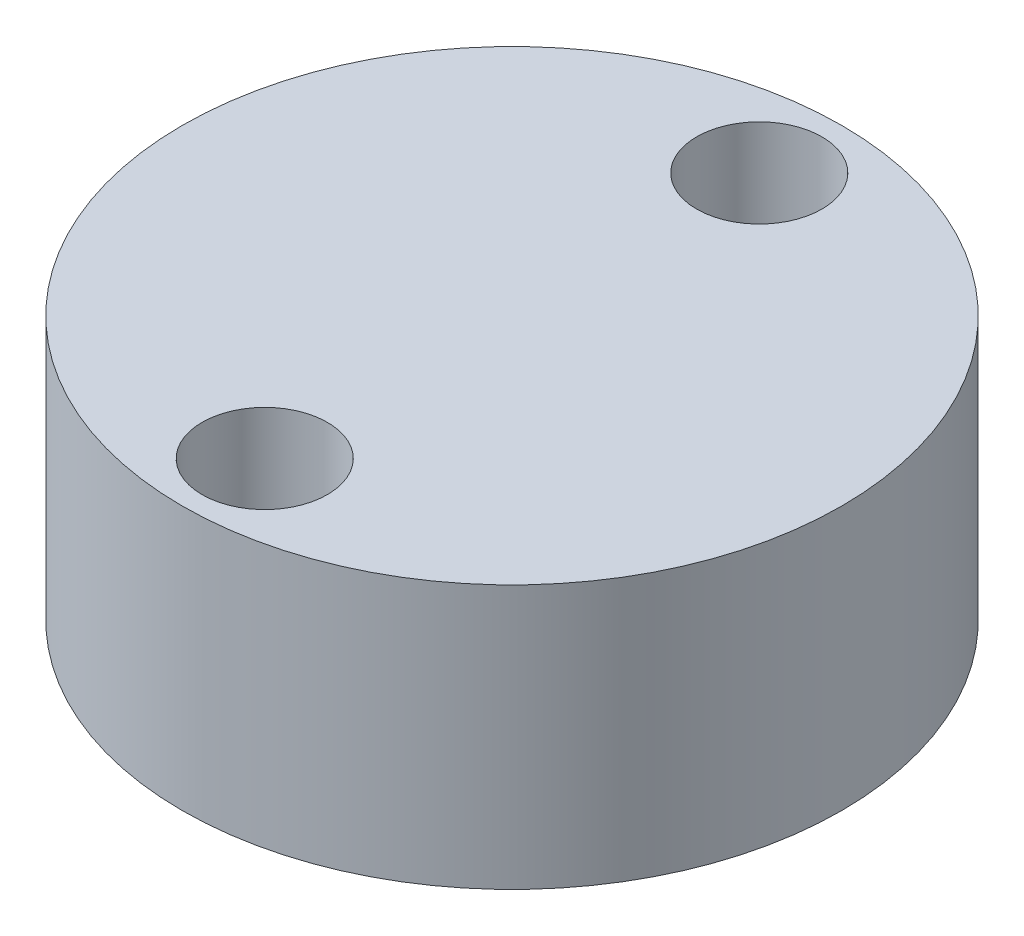
ISO-10303-21;
HEADER;
FILE_DESCRIPTION(('STEP AP214'),'2;1');
FILE_NAME('part.step','',(''),(''),'','','');
FILE_SCHEMA(('AUTOMOTIVE_DESIGN { 1 0 10303 214 1 1 1 1 }'));
ENDSEC;
DATA;
#1=APPLICATION_CONTEXT('core data for automotive mechanical design processes');
#2=APPLICATION_PROTOCOL_DEFINITION('international standard','automotive_design',2000,#1);
#3=PRODUCT_CONTEXT('',#1,'mechanical');
#4=PRODUCT('Part','Part','',(#3));
#5=PRODUCT_RELATED_PRODUCT_CATEGORY('part','',(#4));
#6=PRODUCT_DEFINITION_FORMATION('','',#4);
#7=PRODUCT_DEFINITION_CONTEXT('part definition',#1,'design');
#8=PRODUCT_DEFINITION('design','',#6,#7);
#9=PRODUCT_DEFINITION_SHAPE('','',#8);
#10=(LENGTH_UNIT() NAMED_UNIT(*) SI_UNIT(.MILLI.,.METRE.));
#11=(NAMED_UNIT(*) PLANE_ANGLE_UNIT() SI_UNIT($,.RADIAN.));
#12=(NAMED_UNIT(*) SI_UNIT($,.STERADIAN.) SOLID_ANGLE_UNIT());
#13=UNCERTAINTY_MEASURE_WITH_UNIT(LENGTH_MEASURE(1.E-05),#10,'distance_accuracy_value','');
#14=(GEOMETRIC_REPRESENTATION_CONTEXT(3) GLOBAL_UNCERTAINTY_ASSIGNED_CONTEXT((#13)) GLOBAL_UNIT_ASSIGNED_CONTEXT((#10,
#11,#12)) REPRESENTATION_CONTEXT('',''));
#15=CARTESIAN_POINT('',(0.,0.,0.));
#16=DIRECTION('',(0.,0.,1.));
#17=DIRECTION('',(1.,0.,0.));
#18=AXIS2_PLACEMENT_3D('',#15,#16,#17);
#19=CARTESIAN_POINT('',(0.,4.,-3.75));
#20=DIRECTION('',(0.,-1.,0.));
#21=DIRECTION('',(0.,0.,-1.));
#22=AXIS2_PLACEMENT_3D('',#19,#20,#21);
#23=CYLINDRICAL_SURFACE('',#22,0.5);
#24=CARTESIAN_POINT('',(0.,0.,-3.75));
#25=DIRECTION('',(0.,1.,0.));
#26=DIRECTION('',(0.,0.,1.));
#27=AXIS2_PLACEMENT_3D('',#24,#25,#26);
#28=CIRCLE('',#27,0.5);
#29=CARTESIAN_POINT('',(0.,0.,-3.25));
#30=VERTEX_POINT('',#29);
#31=EDGE_CURVE('E44',#30,#30,#28,.T.);
#32=ORIENTED_EDGE('',*,*,#31,.F.);
#33=EDGE_LOOP('',(#32));
#34=FACE_BOUND('',#33,.T.);
#35=CARTESIAN_POINT('',(0.,2.,-3.75));
#36=DIRECTION('',(0.,1.,0.));
#37=DIRECTION('',(0.,0.,1.));
#38=AXIS2_PLACEMENT_3D('',#35,#36,#37);
#39=CIRCLE('',#38,0.5);
#40=CARTESIAN_POINT('',(0.,2.,-3.25));
#41=VERTEX_POINT('',#40);
#42=EDGE_CURVE('E35',#41,#41,#39,.T.);
#43=ORIENTED_EDGE('',*,*,#42,.T.);
#44=EDGE_LOOP('',(#43));
#45=FACE_BOUND('',#44,.T.);
#46=ADVANCED_FACE('F31',(#34,#45),#23,.F.);
#47=CARTESIAN_POINT('',(0.,4.,3.75));
#48=DIRECTION('',(0.,-1.,0.));
#49=DIRECTION('',(0.,0.,-1.));
#50=AXIS2_PLACEMENT_3D('',#47,#48,#49);
#51=CYLINDRICAL_SURFACE('',#50,0.5);
#52=CARTESIAN_POINT('',(0.,0.,3.75));
#53=DIRECTION('',(0.,1.,0.));
#54=DIRECTION('',(0.,0.,1.));
#55=AXIS2_PLACEMENT_3D('',#52,#53,#54);
#56=CIRCLE('',#55,0.5);
#57=CARTESIAN_POINT('',(0.,0.,4.25));
#58=VERTEX_POINT('',#57);
#59=EDGE_CURVE('E54',#58,#58,#56,.T.);
#60=ORIENTED_EDGE('',*,*,#59,.F.);
#61=EDGE_LOOP('',(#60));
#62=FACE_BOUND('',#61,.T.);
#63=CARTESIAN_POINT('',(0.,2.,3.75));
#64=DIRECTION('',(0.,1.,0.));
#65=DIRECTION('',(0.,0.,1.));
#66=AXIS2_PLACEMENT_3D('',#63,#64,#65);
#67=CIRCLE('',#66,0.5);
#68=CARTESIAN_POINT('',(0.,2.,4.25));
#69=VERTEX_POINT('',#68);
#70=EDGE_CURVE('E48',#69,#69,#67,.T.);
#71=ORIENTED_EDGE('',*,*,#70,.T.);
#72=EDGE_LOOP('',(#71));
#73=FACE_BOUND('',#72,.T.);
#74=ADVANCED_FACE('F78',(#62,#73),#51,.F.);
#75=CARTESIAN_POINT('',(0.,4.,0.));
#76=DIRECTION('',(0.,1.,0.));
#77=DIRECTION('',(0.,0.,1.));
#78=AXIS2_PLACEMENT_3D('',#75,#76,#77);
#79=PLANE('',#78);
#80=CARTESIAN_POINT('',(0.,4.,-3.75));
#81=DIRECTION('',(0.,1.,0.));
#82=DIRECTION('',(0.,0.,1.));
#83=AXIS2_PLACEMENT_3D('',#80,#81,#82);
#84=CIRCLE('',#83,0.95);
#85=CARTESIAN_POINT('',(0.,4.,-2.8));
#86=VERTEX_POINT('',#85);
#87=EDGE_CURVE('E56',#86,#86,#84,.T.);
#88=ORIENTED_EDGE('',*,*,#87,.F.);
#89=EDGE_LOOP('',(#88));
#90=FACE_BOUND('',#89,.T.);
#91=CARTESIAN_POINT('',(0.,4.,3.75));
#92=DIRECTION('',(0.,1.,0.));
#93=DIRECTION('',(0.,0.,1.));
#94=AXIS2_PLACEMENT_3D('',#91,#92,#93);
#95=CIRCLE('',#94,0.95);
#96=CARTESIAN_POINT('',(0.,4.,4.7));
#97=VERTEX_POINT('',#96);
#98=EDGE_CURVE('E66',#97,#97,#95,.T.);
#99=ORIENTED_EDGE('',*,*,#98,.F.);
#100=EDGE_LOOP('',(#99));
#101=FACE_BOUND('',#100,.T.);
#102=CARTESIAN_POINT('',(0.,4.,0.));
#103=DIRECTION('',(0.,1.,0.));
#104=DIRECTION('',(0.,0.,1.));
#105=AXIS2_PLACEMENT_3D('',#102,#103,#104);
#106=CIRCLE('',#105,5.);
#107=CARTESIAN_POINT('',(0.,4.,5.));
#108=VERTEX_POINT('',#107);
#109=EDGE_CURVE('E10',#108,#108,#106,.T.);
#110=ORIENTED_EDGE('',*,*,#109,.T.);
#111=EDGE_LOOP('',(#110));
#112=FACE_BOUND('',#111,.T.);
#113=ADVANCED_FACE('F101',(#90,#101,#112),#79,.T.);
#114=CARTESIAN_POINT('',(0.,0.,0.));
#115=DIRECTION('',(0.,1.,0.));
#116=DIRECTION('',(0.,0.,1.));
#117=AXIS2_PLACEMENT_3D('',#114,#115,#116);
#118=PLANE('',#117);
#119=CARTESIAN_POINT('',(0.,0.,0.));
#120=DIRECTION('',(0.,1.,0.));
#121=DIRECTION('',(0.,0.,1.));
#122=AXIS2_PLACEMENT_3D('',#119,#120,#121);
#123=CIRCLE('',#122,5.);
#124=CARTESIAN_POINT('',(0.,0.,5.));
#125=VERTEX_POINT('',#124);
#126=EDGE_CURVE('E39',#125,#125,#123,.T.);
#127=ORIENTED_EDGE('',*,*,#126,.F.);
#128=EDGE_LOOP('',(#127));
#129=FACE_BOUND('',#128,.T.);
#130=ORIENTED_EDGE('',*,*,#31,.T.);
#131=EDGE_LOOP('',(#130));
#132=FACE_BOUND('',#131,.T.);
#133=ORIENTED_EDGE('',*,*,#59,.T.);
#134=EDGE_LOOP('',(#133));
#135=FACE_BOUND('',#134,.T.);
#136=ADVANCED_FACE('F74',(#129,#132,#135),#118,.F.);
#137=CARTESIAN_POINT('',(0.,4.,0.));
#138=DIRECTION('',(0.,-1.,0.));
#139=DIRECTION('',(0.,0.,-1.));
#140=AXIS2_PLACEMENT_3D('',#137,#138,#139);
#141=CYLINDRICAL_SURFACE('',#140,5.);
#142=ORIENTED_EDGE('',*,*,#109,.F.);
#143=EDGE_LOOP('',(#142));
#144=FACE_BOUND('',#143,.T.);
#145=ORIENTED_EDGE('',*,*,#126,.T.);
#146=EDGE_LOOP('',(#145));
#147=FACE_BOUND('',#146,.T.);
#148=ADVANCED_FACE('F33',(#144,#147),#141,.T.);
#149=CARTESIAN_POINT('',(0.,2.,3.75));
#150=DIRECTION('',(0.,1.,0.));
#151=DIRECTION('',(0.,0.,1.));
#152=AXIS2_PLACEMENT_3D('',#149,#150,#151);
#153=CYLINDRICAL_SURFACE('',#152,0.95);
#154=CARTESIAN_POINT('',(0.,2.,3.75));
#155=DIRECTION('',(0.,1.,0.));
#156=DIRECTION('',(0.,0.,1.));
#157=AXIS2_PLACEMENT_3D('',#154,#155,#156);
#158=CIRCLE('',#157,0.95);
#159=CARTESIAN_POINT('',(0.,2.,4.7));
#160=VERTEX_POINT('',#159);
#161=EDGE_CURVE('E61',#160,#160,#158,.T.);
#162=ORIENTED_EDGE('',*,*,#161,.F.);
#163=EDGE_LOOP('',(#162));
#164=FACE_BOUND('',#163,.T.);
#165=ORIENTED_EDGE('',*,*,#98,.T.);
#166=EDGE_LOOP('',(#165));
#167=FACE_BOUND('',#166,.T.);
#168=ADVANCED_FACE('F95',(#164,#167),#153,.F.);
#169=CARTESIAN_POINT('',(0.,2.,3.75));
#170=DIRECTION('',(0.,1.,0.));
#171=DIRECTION('',(0.,0.,1.));
#172=AXIS2_PLACEMENT_3D('',#169,#170,#171);
#173=PLANE('',#172);
#174=ORIENTED_EDGE('',*,*,#70,.F.);
#175=EDGE_LOOP('',(#174));
#176=FACE_BOUND('',#175,.T.);
#177=ORIENTED_EDGE('',*,*,#161,.T.);
#178=EDGE_LOOP('',(#177));
#179=FACE_BOUND('',#178,.T.);
#180=ADVANCED_FACE('F89',(#176,#179),#173,.T.);
#181=CARTESIAN_POINT('',(0.,2.,-3.75));
#182=DIRECTION('',(0.,1.,0.));
#183=DIRECTION('',(0.,0.,1.));
#184=AXIS2_PLACEMENT_3D('',#181,#182,#183);
#185=CYLINDRICAL_SURFACE('',#184,0.95);
#186=CARTESIAN_POINT('',(0.,2.,-3.75));
#187=DIRECTION('',(0.,1.,0.));
#188=DIRECTION('',(0.,0.,1.));
#189=AXIS2_PLACEMENT_3D('',#186,#187,#188);
#190=CIRCLE('',#189,0.95);
#191=CARTESIAN_POINT('',(0.,2.,-2.8));
#192=VERTEX_POINT('',#191);
#193=EDGE_CURVE('E50',#192,#192,#190,.T.);
#194=ORIENTED_EDGE('',*,*,#193,.F.);
#195=EDGE_LOOP('',(#194));
#196=FACE_BOUND('',#195,.T.);
#197=ORIENTED_EDGE('',*,*,#87,.T.);
#198=EDGE_LOOP('',(#197));
#199=FACE_BOUND('',#198,.T.);
#200=ADVANCED_FACE('F84',(#196,#199),#185,.F.);
#201=CARTESIAN_POINT('',(0.,2.,-3.75));
#202=DIRECTION('',(0.,1.,0.));
#203=DIRECTION('',(0.,0.,1.));
#204=AXIS2_PLACEMENT_3D('',#201,#202,#203);
#205=PLANE('',#204);
#206=ORIENTED_EDGE('',*,*,#42,.F.);
#207=EDGE_LOOP('',(#206));
#208=FACE_BOUND('',#207,.T.);
#209=ORIENTED_EDGE('',*,*,#193,.T.);
#210=EDGE_LOOP('',(#209));
#211=FACE_BOUND('',#210,.T.);
#212=ADVANCED_FACE('F82',(#208,#211),#205,.T.);
#213=CLOSED_SHELL('',(#46,#74,#113,#136,#148,#168,#180,#200,#212));
#214=MANIFOLD_SOLID_BREP('B2',#213);
#215=ADVANCED_BREP_SHAPE_REPRESENTATION('',(#18,#214),#14);
#216=SHAPE_DEFINITION_REPRESENTATION(#9,#215);
ENDSEC;
END-ISO-10303-21;
